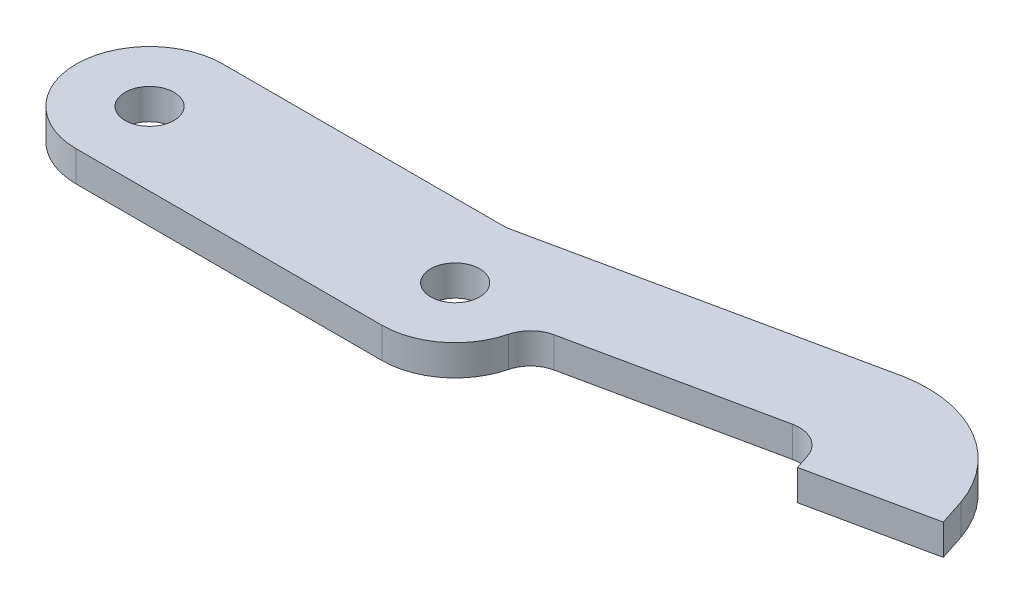
ISO-10303-21;
HEADER;
FILE_DESCRIPTION(('STEP AP214'),'2;1');
FILE_NAME('part.step','',(''),(''),'','','');
FILE_SCHEMA(('AUTOMOTIVE_DESIGN { 1 0 10303 214 1 1 1 1 }'));
ENDSEC;
DATA;
#1=APPLICATION_CONTEXT('core data for automotive mechanical design processes');
#2=APPLICATION_PROTOCOL_DEFINITION('international standard','automotive_design',2000,#1);
#3=PRODUCT_CONTEXT('',#1,'mechanical');
#4=PRODUCT('Part','Part','',(#3));
#5=PRODUCT_RELATED_PRODUCT_CATEGORY('part','',(#4));
#6=PRODUCT_DEFINITION_FORMATION('','',#4);
#7=PRODUCT_DEFINITION_CONTEXT('part definition',#1,'design');
#8=PRODUCT_DEFINITION('design','',#6,#7);
#9=PRODUCT_DEFINITION_SHAPE('','',#8);
#10=(LENGTH_UNIT() NAMED_UNIT(*) SI_UNIT(.MILLI.,.METRE.));
#11=(NAMED_UNIT(*) PLANE_ANGLE_UNIT() SI_UNIT($,.RADIAN.));
#12=(NAMED_UNIT(*) SI_UNIT($,.STERADIAN.) SOLID_ANGLE_UNIT());
#13=UNCERTAINTY_MEASURE_WITH_UNIT(LENGTH_MEASURE(1.E-05),#10,'distance_accuracy_value','');
#14=(GEOMETRIC_REPRESENTATION_CONTEXT(3) GLOBAL_UNCERTAINTY_ASSIGNED_CONTEXT((#13)) GLOBAL_UNIT_ASSIGNED_CONTEXT((#10,
#11,#12)) REPRESENTATION_CONTEXT('',''));
#15=CARTESIAN_POINT('',(0.,0.,0.));
#16=DIRECTION('',(0.,0.,1.));
#17=DIRECTION('',(1.,0.,0.));
#18=AXIS2_PLACEMENT_3D('',#15,#16,#17);
#19=CARTESIAN_POINT('',(77.2033165131237,3.75,-4.24115156953267));
#20=DIRECTION('',(0.,1.,0.));
#21=DIRECTION('',(0.,0.,1.));
#22=AXIS2_PLACEMENT_3D('',#19,#20,#21);
#23=PLANE('',#22);
#24=CARTESIAN_POINT('',(25.4283778031205,3.75,-2.37435628550275));
#25=DIRECTION('',(0.,1.,0.));
#26=DIRECTION('',(0.,0.,1.));
#27=AXIS2_PLACEMENT_3D('',#24,#25,#26);
#28=CIRCLE('',#27,2.);
#29=CARTESIAN_POINT('',(25.4283778031205,3.75,-0.374356285502748));
#30=VERTEX_POINT('',#29);
#31=EDGE_CURVE('E244',#30,#30,#28,.T.);
#32=ORIENTED_EDGE('',*,*,#31,.F.);
#33=EDGE_LOOP('',(#32));
#34=FACE_BOUND('',#33,.T.);
#35=CARTESIAN_POINT('',(77.2033165131237,3.75,-4.24115156953267));
#36=DIRECTION('',(0.,1.,0.));
#37=DIRECTION('',(0.,0.,1.));
#38=AXIS2_PLACEMENT_3D('',#35,#36,#37);
#39=CIRCLE('',#38,10.);
#40=CARTESIAN_POINT('',(86.648154320147,3.75,-7.52673200516709));
#41=VERTEX_POINT('',#40);
#42=CARTESIAN_POINT('',(75.4822098945899,3.75,-14.0919277829911));
#43=VERTEX_POINT('',#42);
#44=EDGE_CURVE('E134',#41,#43,#39,.T.);
#45=ORIENTED_EDGE('',*,*,#44,.T.);
#46=DIRECTION('',(-0.978147600733806,0.,0.20791169081776));
#47=VECTOR('',#46,1.);
#48=CARTESIAN_POINT('',(48.5831508744103,3.75,-8.37435628550275));
#49=LINE('',#48,#47);
#50=CARTESIAN_POINT('',(48.8401695132905,3.75,-8.42898728366823));
#51=VERTEX_POINT('',#50);
#52=EDGE_CURVE('E125',#43,#51,#49,.T.);
#53=ORIENTED_EDGE('',*,*,#52,.T.);
#54=CARTESIAN_POINT('',(48.3203902862461,3.75,-10.8743562855027));
#55=DIRECTION('',(0.,1.,0.));
#56=DIRECTION('',(0.,0.,1.));
#57=AXIS2_PLACEMENT_3D('',#54,#55,#56);
#58=CIRCLE('',#57,2.5);
#59=CARTESIAN_POINT('',(48.3203902862461,3.75,-8.37435628550275));
#60=VERTEX_POINT('',#59);
#61=EDGE_CURVE('E11',#51,#60,#58,.F.);
#62=ORIENTED_EDGE('',*,*,#61,.T.);
#63=DIRECTION('',(-1.,0.,0.));
#64=VECTOR('',#63,1.);
#65=CARTESIAN_POINT('',(25.4283778031205,3.75,-8.37435628550275));
#66=LINE('',#65,#64);
#67=CARTESIAN_POINT('',(25.4283778031205,3.75,-8.37435628550275));
#68=VERTEX_POINT('',#67);
#69=EDGE_CURVE('E133',#60,#68,#66,.T.);
#70=ORIENTED_EDGE('',*,*,#69,.T.);
#71=CARTESIAN_POINT('',(25.4283778031205,3.75,-2.37435628550275));
#72=DIRECTION('',(0.,1.,0.));
#73=DIRECTION('',(0.,0.,1.));
#74=AXIS2_PLACEMENT_3D('',#71,#72,#73);
#75=CIRCLE('',#74,6.);
#76=CARTESIAN_POINT('',(25.4283778031205,3.75,3.62564371449725));
#77=VERTEX_POINT('',#76);
#78=EDGE_CURVE('E252',#68,#77,#75,.T.);
#79=ORIENTED_EDGE('',*,*,#78,.T.);
#80=DIRECTION('',(1.,0.,0.));
#81=VECTOR('',#80,1.);
#82=CARTESIAN_POINT('',(25.4283778031205,3.75,3.62564371449725));
#83=LINE('',#82,#81);
#84=CARTESIAN_POINT('',(50.4283778031205,3.75,3.62564371449725));
#85=VERTEX_POINT('',#84);
#86=EDGE_CURVE('E231',#77,#85,#83,.T.);
#87=ORIENTED_EDGE('',*,*,#86,.T.);
#88=CARTESIAN_POINT('',(50.4283778031205,3.75,-2.37435628550275));
#89=DIRECTION('',(0.,1.,0.));
#90=DIRECTION('',(0.,0.,1.));
#91=AXIS2_PLACEMENT_3D('',#88,#89,#90);
#92=CIRCLE('',#91,6.);
#93=CARTESIAN_POINT('',(56.2460768440043,3.75,-0.906576373629143));
#94=VERTEX_POINT('',#93);
#95=EDGE_CURVE('E248',#85,#94,#92,.T.);
#96=ORIENTED_EDGE('',*,*,#95,.T.);
#97=CARTESIAN_POINT('',(58.6701181110392,3.75,-0.295001410348475));
#98=DIRECTION('',(0.,1.,0.));
#99=DIRECTION('',(0.,0.,1.));
#100=AXIS2_PLACEMENT_3D('',#97,#98,#99);
#101=CIRCLE('',#100,2.5);
#102=CARTESIAN_POINT('',(58.1503388839948,3.75,-2.74037041218299));
#103=VERTEX_POINT('',#102);
#104=EDGE_CURVE('E171',#94,#103,#101,.F.);
#105=ORIENTED_EDGE('',*,*,#104,.T.);
#106=DIRECTION('',(0.978147600733805,0.,-0.20791169081776));
#107=VECTOR('',#106,1.);
#108=CARTESIAN_POINT('',(56.4283778031205,3.75,-2.37435628550275));
#109=LINE('',#108,#107);
#110=CARTESIAN_POINT('',(74.2247109521193,3.75,-6.15708366998819));
#111=VERTEX_POINT('',#110);
#112=EDGE_CURVE('E182',#103,#111,#109,.T.);
#113=ORIENTED_EDGE('',*,*,#112,.T.);
#114=CARTESIAN_POINT('',(74.7444901791637,3.75,-3.71171466815367));
#115=DIRECTION('',(0.,1.,0.));
#116=DIRECTION('',(0.,0.,1.));
#117=AXIS2_PLACEMENT_3D('',#114,#115,#116);
#118=CIRCLE('',#117,2.5);
#119=CARTESIAN_POINT('',(77.1227747991611,3.75,-4.4822743778998));
#120=VERTEX_POINT('',#119);
#121=EDGE_CURVE('E175',#111,#120,#118,.F.);
#122=ORIENTED_EDGE('',*,*,#121,.T.);
#123=DIRECTION('',(0.308223883898451,0.,0.951313847998942));
#124=VECTOR('',#123,1.);
#125=CARTESIAN_POINT('',(77.5071613967651,3.75,-3.2958890509069));
#126=LINE('',#125,#124);
#127=CARTESIAN_POINT('',(77.5071613967651,3.75,-3.2958890509069));
#128=VERTEX_POINT('',#127);
#129=EDGE_CURVE('E179',#120,#128,#126,.T.);
#130=ORIENTED_EDGE('',*,*,#129,.T.);
#131=DIRECTION('',(0.978147600733807,0.,-0.207911690817753));
#132=VECTOR('',#131,1.);
#133=CARTESIAN_POINT('',(77.5071613967651,3.75,-3.2958890509069));
#134=LINE('',#133,#132);
#135=CARTESIAN_POINT('',(87.3416580589185,3.75,-5.38627584716947));
#136=VERTEX_POINT('',#135);
#137=EDGE_CURVE('E192',#128,#136,#134,.T.);
#138=ORIENTED_EDGE('',*,*,#137,.T.);
#139=DIRECTION('',(-0.308223883898451,0.,-0.951313847998942));
#140=VECTOR('',#139,1.);
#141=CARTESIAN_POINT('',(86.648154320147,3.75,-7.52673200516709));
#142=LINE('',#141,#140);
#143=EDGE_CURVE('E139',#136,#41,#142,.T.);
#144=ORIENTED_EDGE('',*,*,#143,.T.);
#145=EDGE_LOOP('',(#45,#53,#62,#70,#79,#87,#96,#105,#113,#122,#130,#138,#144));
#146=FACE_BOUND('',#145,.T.);
#147=CARTESIAN_POINT('',(50.4283778031205,3.75,-2.37435628550275));
#148=DIRECTION('',(0.,1.,0.));
#149=DIRECTION('',(0.,0.,1.));
#150=AXIS2_PLACEMENT_3D('',#147,#148,#149);
#151=CIRCLE('',#150,2.);
#152=CARTESIAN_POINT('',(50.4283778031205,3.75,-0.374356285502745));
#153=VERTEX_POINT('',#152);
#154=EDGE_CURVE('E258',#153,#153,#151,.T.);
#155=ORIENTED_EDGE('',*,*,#154,.F.);
#156=EDGE_LOOP('',(#155));
#157=FACE_BOUND('',#156,.T.);
#158=ADVANCED_FACE('F34',(#34,#146,#157),#23,.T.);
#159=CARTESIAN_POINT('',(77.2033165131237,1.25,-4.24115156953267));
#160=DIRECTION('',(0.,1.,0.));
#161=DIRECTION('',(0.,0.,1.));
#162=AXIS2_PLACEMENT_3D('',#159,#160,#161);
#163=PLANE('',#162);
#164=CARTESIAN_POINT('',(25.4283778031205,1.25,-2.37435628550275));
#165=DIRECTION('',(0.,1.,0.));
#166=DIRECTION('',(0.,0.,1.));
#167=AXIS2_PLACEMENT_3D('',#164,#165,#166);
#168=CIRCLE('',#167,2.);
#169=CARTESIAN_POINT('',(25.4283778031205,1.25,-0.374356285502748));
#170=VERTEX_POINT('',#169);
#171=EDGE_CURVE('E255',#170,#170,#168,.T.);
#172=ORIENTED_EDGE('',*,*,#171,.T.);
#173=EDGE_LOOP('',(#172));
#174=FACE_BOUND('',#173,.T.);
#175=CARTESIAN_POINT('',(77.2033165131237,1.25,-4.24115156953267));
#176=DIRECTION('',(0.,1.,0.));
#177=DIRECTION('',(0.,0.,1.));
#178=AXIS2_PLACEMENT_3D('',#175,#176,#177);
#179=CIRCLE('',#178,10.);
#180=CARTESIAN_POINT('',(86.648154320147,1.25,-7.52673200516709));
#181=VERTEX_POINT('',#180);
#182=CARTESIAN_POINT('',(75.4822098945899,1.25,-14.0919277829911));
#183=VERTEX_POINT('',#182);
#184=EDGE_CURVE('E147',#181,#183,#179,.T.);
#185=ORIENTED_EDGE('',*,*,#184,.F.);
#186=DIRECTION('',(-0.308223883898451,0.,-0.951313847998942));
#187=VECTOR('',#186,1.);
#188=CARTESIAN_POINT('',(86.648154320147,1.25,-7.52673200516709));
#189=LINE('',#188,#187);
#190=CARTESIAN_POINT('',(87.3416580589185,1.25,-5.38627584716947));
#191=VERTEX_POINT('',#190);
#192=EDGE_CURVE('E143',#191,#181,#189,.T.);
#193=ORIENTED_EDGE('',*,*,#192,.F.);
#194=DIRECTION('',(0.978147600733807,0.,-0.207911690817753));
#195=VECTOR('',#194,1.);
#196=CARTESIAN_POINT('',(77.5071613967651,1.25,-3.2958890509069));
#197=LINE('',#196,#195);
#198=CARTESIAN_POINT('',(77.5071613967651,1.25,-3.2958890509069));
#199=VERTEX_POINT('',#198);
#200=EDGE_CURVE('E207',#199,#191,#197,.T.);
#201=ORIENTED_EDGE('',*,*,#200,.F.);
#202=DIRECTION('',(0.308223883898451,0.,0.951313847998942));
#203=VECTOR('',#202,1.);
#204=CARTESIAN_POINT('',(77.5071613967651,1.25,-3.2958890509069));
#205=LINE('',#204,#203);
#206=CARTESIAN_POINT('',(77.1227747991611,1.25,-4.4822743778998));
#207=VERTEX_POINT('',#206);
#208=EDGE_CURVE('E201',#207,#199,#205,.T.);
#209=ORIENTED_EDGE('',*,*,#208,.F.);
#210=CARTESIAN_POINT('',(74.7444901791637,1.25,-3.71171466815367));
#211=DIRECTION('',(0.,1.,0.));
#212=DIRECTION('',(0.,0.,1.));
#213=AXIS2_PLACEMENT_3D('',#210,#211,#212);
#214=CIRCLE('',#213,2.5);
#215=CARTESIAN_POINT('',(74.2247109521193,1.25,-6.15708366998819));
#216=VERTEX_POINT('',#215);
#217=EDGE_CURVE('E173',#207,#216,#214,.T.);
#218=ORIENTED_EDGE('',*,*,#217,.T.);
#219=DIRECTION('',(0.978147600733805,0.,-0.20791169081776));
#220=VECTOR('',#219,1.);
#221=CARTESIAN_POINT('',(56.4283778031205,1.25,-2.37435628550275));
#222=LINE('',#221,#220);
#223=CARTESIAN_POINT('',(58.1503388839948,1.25,-2.74037041218299));
#224=VERTEX_POINT('',#223);
#225=EDGE_CURVE('E199',#224,#216,#222,.T.);
#226=ORIENTED_EDGE('',*,*,#225,.F.);
#227=CARTESIAN_POINT('',(58.6701181110392,1.25,-0.295001410348475));
#228=DIRECTION('',(0.,1.,0.));
#229=DIRECTION('',(0.,0.,1.));
#230=AXIS2_PLACEMENT_3D('',#227,#228,#229);
#231=CIRCLE('',#230,2.5);
#232=CARTESIAN_POINT('',(56.2460768440043,1.25,-0.906576373629143));
#233=VERTEX_POINT('',#232);
#234=EDGE_CURVE('E169',#224,#233,#231,.T.);
#235=ORIENTED_EDGE('',*,*,#234,.T.);
#236=CARTESIAN_POINT('',(50.4283778031205,1.25,-2.37435628550275));
#237=DIRECTION('',(0.,1.,0.));
#238=DIRECTION('',(0.,0.,1.));
#239=AXIS2_PLACEMENT_3D('',#236,#237,#238);
#240=CIRCLE('',#239,6.);
#241=CARTESIAN_POINT('',(50.4283778031205,1.25,3.62564371449725));
#242=VERTEX_POINT('',#241);
#243=EDGE_CURVE('E205',#242,#233,#240,.T.);
#244=ORIENTED_EDGE('',*,*,#243,.F.);
#245=DIRECTION('',(1.,0.,0.));
#246=VECTOR('',#245,1.);
#247=CARTESIAN_POINT('',(25.4283778031205,1.25,3.62564371449725));
#248=LINE('',#247,#246);
#249=CARTESIAN_POINT('',(25.4283778031205,1.25,3.62564371449725));
#250=VERTEX_POINT('',#249);
#251=EDGE_CURVE('E210',#250,#242,#248,.T.);
#252=ORIENTED_EDGE('',*,*,#251,.F.);
#253=CARTESIAN_POINT('',(25.4283778031205,1.25,-2.37435628550275));
#254=DIRECTION('',(0.,1.,0.));
#255=DIRECTION('',(0.,0.,1.));
#256=AXIS2_PLACEMENT_3D('',#253,#254,#255);
#257=CIRCLE('',#256,6.);
#258=CARTESIAN_POINT('',(25.4283778031205,1.25,-8.37435628550275));
#259=VERTEX_POINT('',#258);
#260=EDGE_CURVE('E236',#259,#250,#257,.T.);
#261=ORIENTED_EDGE('',*,*,#260,.F.);
#262=DIRECTION('',(-1.,0.,0.));
#263=VECTOR('',#262,1.);
#264=CARTESIAN_POINT('',(25.4283778031205,1.25,-8.37435628550275));
#265=LINE('',#264,#263);
#266=CARTESIAN_POINT('',(48.3203902862461,1.25,-8.37435628550275));
#267=VERTEX_POINT('',#266);
#268=EDGE_CURVE('E237',#267,#259,#265,.T.);
#269=ORIENTED_EDGE('',*,*,#268,.F.);
#270=CARTESIAN_POINT('',(48.3203902862461,1.25,-10.8743562855027));
#271=DIRECTION('',(0.,1.,0.));
#272=DIRECTION('',(0.,0.,1.));
#273=AXIS2_PLACEMENT_3D('',#270,#271,#272);
#274=CIRCLE('',#273,2.5);
#275=CARTESIAN_POINT('',(48.8401695132905,1.25,-8.42898728366823));
#276=VERTEX_POINT('',#275);
#277=EDGE_CURVE('E42',#267,#276,#274,.T.);
#278=ORIENTED_EDGE('',*,*,#277,.T.);
#279=DIRECTION('',(-0.978147600733806,0.,0.20791169081776));
#280=VECTOR('',#279,1.);
#281=CARTESIAN_POINT('',(48.5831508744103,1.25,-8.37435628550275));
#282=LINE('',#281,#280);
#283=EDGE_CURVE('E241',#183,#276,#282,.T.);
#284=ORIENTED_EDGE('',*,*,#283,.F.);
#285=EDGE_LOOP('',(#185,#193,#201,#209,#218,#226,#235,#244,#252,#261,#269,#278,#284));
#286=FACE_BOUND('',#285,.T.);
#287=CARTESIAN_POINT('',(50.4283778031205,1.25,-2.37435628550275));
#288=DIRECTION('',(0.,1.,0.));
#289=DIRECTION('',(0.,0.,1.));
#290=AXIS2_PLACEMENT_3D('',#287,#288,#289);
#291=CIRCLE('',#290,2.);
#292=CARTESIAN_POINT('',(50.4283778031205,1.25,-0.374356285502745));
#293=VERTEX_POINT('',#292);
#294=EDGE_CURVE('E261',#293,#293,#291,.T.);
#295=ORIENTED_EDGE('',*,*,#294,.T.);
#296=EDGE_LOOP('',(#295));
#297=FACE_BOUND('',#296,.T.);
#298=ADVANCED_FACE('F197',(#174,#286,#297),#163,.F.);
#299=CARTESIAN_POINT('',(77.2033165131237,3.75,-4.24115156953267));
#300=DIRECTION('',(0.,-1.,0.));
#301=DIRECTION('',(0.,0.,-1.));
#302=AXIS2_PLACEMENT_3D('',#299,#300,#301);
#303=CYLINDRICAL_SURFACE('',#302,10.);
#304=ORIENTED_EDGE('',*,*,#184,.T.);
#305=DIRECTION('',(0.,-1.,0.));
#306=VECTOR('',#305,1.);
#307=CARTESIAN_POINT('',(75.4822098945899,3.75,-14.0919277829911));
#308=LINE('',#307,#306);
#309=EDGE_CURVE('E129',#43,#183,#308,.T.);
#310=ORIENTED_EDGE('',*,*,#309,.F.);
#311=ORIENTED_EDGE('',*,*,#44,.F.);
#312=DIRECTION('',(0.,-1.,0.));
#313=VECTOR('',#312,1.);
#314=CARTESIAN_POINT('',(86.648154320147,3.75,-7.52673200516709));
#315=LINE('',#314,#313);
#316=EDGE_CURVE('E216',#41,#181,#315,.T.);
#317=ORIENTED_EDGE('',*,*,#316,.T.);
#318=EDGE_LOOP('',(#304,#310,#311,#317));
#319=FACE_BOUND('',#318,.T.);
#320=ADVANCED_FACE('F145',(#319),#303,.T.);
#321=CARTESIAN_POINT('',(48.5831508744103,3.75,-8.37435628550275));
#322=DIRECTION('',(0.20791169081776,0.,0.978147600733805));
#323=DIRECTION('',(0.978147600733805,0.,-0.20791169081776));
#324=AXIS2_PLACEMENT_3D('',#321,#322,#323);
#325=PLANE('',#324);
#326=ORIENTED_EDGE('',*,*,#283,.T.);
#327=DIRECTION('',(0.,-1.,0.));
#328=VECTOR('',#327,1.);
#329=CARTESIAN_POINT('',(48.8401695132905,3.75,-8.42898728366823));
#330=LINE('',#329,#328);
#331=EDGE_CURVE('E49',#276,#51,#330,.F.);
#332=ORIENTED_EDGE('',*,*,#331,.T.);
#333=ORIENTED_EDGE('',*,*,#52,.F.);
#334=ORIENTED_EDGE('',*,*,#309,.T.);
#335=EDGE_LOOP('',(#326,#332,#333,#334));
#336=FACE_BOUND('',#335,.T.);
#337=ADVANCED_FACE('F127',(#336),#325,.F.);
#338=CARTESIAN_POINT('',(25.4283778031205,3.75,-8.37435628550275));
#339=DIRECTION('',(0.,0.,1.));
#340=DIRECTION('',(1.,0.,0.));
#341=AXIS2_PLACEMENT_3D('',#338,#339,#340);
#342=PLANE('',#341);
#343=ORIENTED_EDGE('',*,*,#69,.F.);
#344=DIRECTION('',(0.,-1.,0.));
#345=VECTOR('',#344,1.);
#346=CARTESIAN_POINT('',(48.3203902862461,1.25,-8.37435628550275));
#347=LINE('',#346,#345);
#348=EDGE_CURVE('E165',#60,#267,#347,.T.);
#349=ORIENTED_EDGE('',*,*,#348,.T.);
#350=ORIENTED_EDGE('',*,*,#268,.T.);
#351=DIRECTION('',(0.,-1.,0.));
#352=VECTOR('',#351,1.);
#353=CARTESIAN_POINT('',(25.4283778031205,3.75,-8.37435628550275));
#354=LINE('',#353,#352);
#355=EDGE_CURVE('E149',#68,#259,#354,.T.);
#356=ORIENTED_EDGE('',*,*,#355,.F.);
#357=EDGE_LOOP('',(#343,#349,#350,#356));
#358=FACE_BOUND('',#357,.T.);
#359=ADVANCED_FACE('F303',(#358),#342,.F.);
#360=CARTESIAN_POINT('',(25.4283778031205,3.75,-2.37435628550275));
#361=DIRECTION('',(0.,-1.,0.));
#362=DIRECTION('',(0.,0.,-1.));
#363=AXIS2_PLACEMENT_3D('',#360,#361,#362);
#364=CYLINDRICAL_SURFACE('',#363,6.);
#365=ORIENTED_EDGE('',*,*,#260,.T.);
#366=DIRECTION('',(0.,-1.,0.));
#367=VECTOR('',#366,1.);
#368=CARTESIAN_POINT('',(25.4283778031205,3.75,3.62564371449725));
#369=LINE('',#368,#367);
#370=EDGE_CURVE('E154',#77,#250,#369,.T.);
#371=ORIENTED_EDGE('',*,*,#370,.F.);
#372=ORIENTED_EDGE('',*,*,#78,.F.);
#373=ORIENTED_EDGE('',*,*,#355,.T.);
#374=EDGE_LOOP('',(#365,#371,#372,#373));
#375=FACE_BOUND('',#374,.T.);
#376=ADVANCED_FACE('F300',(#375),#364,.T.);
#377=CARTESIAN_POINT('',(25.4283778031205,3.75,3.62564371449725));
#378=DIRECTION('',(0.,0.,-1.));
#379=DIRECTION('',(-1.,0.,0.));
#380=AXIS2_PLACEMENT_3D('',#377,#378,#379);
#381=PLANE('',#380);
#382=ORIENTED_EDGE('',*,*,#251,.T.);
#383=DIRECTION('',(0.,-1.,0.));
#384=VECTOR('',#383,1.);
#385=CARTESIAN_POINT('',(50.4283778031205,3.75,3.62564371449725));
#386=LINE('',#385,#384);
#387=EDGE_CURVE('E222',#85,#242,#386,.T.);
#388=ORIENTED_EDGE('',*,*,#387,.F.);
#389=ORIENTED_EDGE('',*,*,#86,.F.);
#390=ORIENTED_EDGE('',*,*,#370,.T.);
#391=EDGE_LOOP('',(#382,#388,#389,#390));
#392=FACE_BOUND('',#391,.T.);
#393=ADVANCED_FACE('F229',(#392),#381,.F.);
#394=CARTESIAN_POINT('',(50.4283778031205,3.75,-2.37435628550275));
#395=DIRECTION('',(0.,-1.,0.));
#396=DIRECTION('',(0.,0.,-1.));
#397=AXIS2_PLACEMENT_3D('',#394,#395,#396);
#398=CYLINDRICAL_SURFACE('',#397,6.);
#399=ORIENTED_EDGE('',*,*,#243,.T.);
#400=DIRECTION('',(0.,-1.,0.));
#401=VECTOR('',#400,1.);
#402=CARTESIAN_POINT('',(56.2460768440043,3.75,-0.906576373629144));
#403=LINE('',#402,#401);
#404=EDGE_CURVE('E160',#233,#94,#403,.F.);
#405=ORIENTED_EDGE('',*,*,#404,.T.);
#406=ORIENTED_EDGE('',*,*,#95,.F.);
#407=ORIENTED_EDGE('',*,*,#387,.T.);
#408=EDGE_LOOP('',(#399,#405,#406,#407));
#409=FACE_BOUND('',#408,.T.);
#410=ADVANCED_FACE('F294',(#409),#398,.T.);
#411=CARTESIAN_POINT('',(56.4283778031205,3.75,-2.37435628550275));
#412=DIRECTION('',(-0.20791169081776,0.,-0.978147600733806));
#413=DIRECTION('',(-0.978147600733806,0.,0.20791169081776));
#414=AXIS2_PLACEMENT_3D('',#411,#412,#413);
#415=PLANE('',#414);
#416=ORIENTED_EDGE('',*,*,#112,.F.);
#417=DIRECTION('',(0.,1.,0.));
#418=VECTOR('',#417,1.);
#419=CARTESIAN_POINT('',(58.1503388839948,1.25,-2.74037041218299));
#420=LINE('',#419,#418);
#421=EDGE_CURVE('E151',#103,#224,#420,.F.);
#422=ORIENTED_EDGE('',*,*,#421,.T.);
#423=ORIENTED_EDGE('',*,*,#225,.T.);
#424=DIRECTION('',(0.,-1.,0.));
#425=VECTOR('',#424,1.);
#426=CARTESIAN_POINT('',(74.2247109521193,3.75,-6.15708366998819));
#427=LINE('',#426,#425);
#428=EDGE_CURVE('E148',#216,#111,#427,.F.);
#429=ORIENTED_EDGE('',*,*,#428,.T.);
#430=EDGE_LOOP('',(#416,#422,#423,#429));
#431=FACE_BOUND('',#430,.T.);
#432=ADVANCED_FACE('F203',(#431),#415,.F.);
#433=CARTESIAN_POINT('',(77.5071613967651,3.75,-3.2958890509069));
#434=DIRECTION('',(0.951313847998942,0.,-0.308223883898451));
#435=DIRECTION('',(-0.308223883898451,0.,-0.951313847998942));
#436=AXIS2_PLACEMENT_3D('',#433,#434,#435);
#437=PLANE('',#436);
#438=ORIENTED_EDGE('',*,*,#129,.F.);
#439=DIRECTION('',(0.,-1.,0.));
#440=VECTOR('',#439,1.);
#441=CARTESIAN_POINT('',(77.1227747991611,1.25,-4.4822743778998));
#442=LINE('',#441,#440);
#443=EDGE_CURVE('E162',#120,#207,#442,.T.);
#444=ORIENTED_EDGE('',*,*,#443,.T.);
#445=ORIENTED_EDGE('',*,*,#208,.T.);
#446=DIRECTION('',(0.,-1.,0.));
#447=VECTOR('',#446,1.);
#448=CARTESIAN_POINT('',(77.5071613967651,3.75,-3.2958890509069));
#449=LINE('',#448,#447);
#450=EDGE_CURVE('E190',#128,#199,#449,.T.);
#451=ORIENTED_EDGE('',*,*,#450,.F.);
#452=EDGE_LOOP('',(#438,#444,#445,#451));
#453=FACE_BOUND('',#452,.T.);
#454=ADVANCED_FACE('F187',(#453),#437,.F.);
#455=CARTESIAN_POINT('',(77.5071613967651,3.75,-3.2958890509069));
#456=DIRECTION('',(-0.207911690817753,0.,-0.978147600733807));
#457=DIRECTION('',(-0.978147600733807,0.,0.207911690817753));
#458=AXIS2_PLACEMENT_3D('',#455,#456,#457);
#459=PLANE('',#458);
#460=ORIENTED_EDGE('',*,*,#200,.T.);
#461=DIRECTION('',(0.,-1.,0.));
#462=VECTOR('',#461,1.);
#463=CARTESIAN_POINT('',(87.3416580589185,3.75,-5.38627584716947));
#464=LINE('',#463,#462);
#465=EDGE_CURVE('E218',#136,#191,#464,.T.);
#466=ORIENTED_EDGE('',*,*,#465,.F.);
#467=ORIENTED_EDGE('',*,*,#137,.F.);
#468=ORIENTED_EDGE('',*,*,#450,.T.);
#469=EDGE_LOOP('',(#460,#466,#467,#468));
#470=FACE_BOUND('',#469,.T.);
#471=ADVANCED_FACE('F285',(#470),#459,.F.);
#472=CARTESIAN_POINT('',(86.648154320147,3.75,-7.52673200516709));
#473=DIRECTION('',(-0.951313847998942,0.,0.308223883898451));
#474=DIRECTION('',(0.308223883898451,0.,0.951313847998942));
#475=AXIS2_PLACEMENT_3D('',#472,#473,#474);
#476=PLANE('',#475);
#477=ORIENTED_EDGE('',*,*,#192,.T.);
#478=ORIENTED_EDGE('',*,*,#316,.F.);
#479=ORIENTED_EDGE('',*,*,#143,.F.);
#480=ORIENTED_EDGE('',*,*,#465,.T.);
#481=EDGE_LOOP('',(#477,#478,#479,#480));
#482=FACE_BOUND('',#481,.T.);
#483=ADVANCED_FACE('F282',(#482),#476,.F.);
#484=CARTESIAN_POINT('',(25.4283778031205,3.75,-2.37435628550275));
#485=DIRECTION('',(0.,-1.,0.));
#486=DIRECTION('',(0.,0.,-1.));
#487=AXIS2_PLACEMENT_3D('',#484,#485,#486);
#488=CYLINDRICAL_SURFACE('',#487,2.);
#489=ORIENTED_EDGE('',*,*,#31,.T.);
#490=EDGE_LOOP('',(#489));
#491=FACE_BOUND('',#490,.T.);
#492=ORIENTED_EDGE('',*,*,#171,.F.);
#493=EDGE_LOOP('',(#492));
#494=FACE_BOUND('',#493,.T.);
#495=ADVANCED_FACE('F279',(#491,#494),#488,.F.);
#496=CARTESIAN_POINT('',(50.4283778031205,3.75,-2.37435628550275));
#497=DIRECTION('',(0.,-1.,0.));
#498=DIRECTION('',(0.,0.,-1.));
#499=AXIS2_PLACEMENT_3D('',#496,#497,#498);
#500=CYLINDRICAL_SURFACE('',#499,2.);
#501=ORIENTED_EDGE('',*,*,#154,.T.);
#502=EDGE_LOOP('',(#501));
#503=FACE_BOUND('',#502,.T.);
#504=ORIENTED_EDGE('',*,*,#294,.F.);
#505=EDGE_LOOP('',(#504));
#506=FACE_BOUND('',#505,.T.);
#507=ADVANCED_FACE('F267',(#503,#506),#500,.F.);
#508=CARTESIAN_POINT('',(58.6701181110392,3.75,-0.295001410348475));
#509=DIRECTION('',(0.,-1.,0.));
#510=DIRECTION('',(0.,0.,-1.));
#511=AXIS2_PLACEMENT_3D('',#508,#509,#510);
#512=CYLINDRICAL_SURFACE('',#511,2.5);
#513=ORIENTED_EDGE('',*,*,#104,.F.);
#514=ORIENTED_EDGE('',*,*,#404,.F.);
#515=ORIENTED_EDGE('',*,*,#234,.F.);
#516=ORIENTED_EDGE('',*,*,#421,.F.);
#517=EDGE_LOOP('',(#513,#514,#515,#516));
#518=FACE_BOUND('',#517,.T.);
#519=ADVANCED_FACE('F311',(#518),#512,.F.);
#520=CARTESIAN_POINT('',(74.7444901791637,3.75,-3.71171466815367));
#521=DIRECTION('',(0.,1.,0.));
#522=DIRECTION('',(0.,0.,1.));
#523=AXIS2_PLACEMENT_3D('',#520,#521,#522);
#524=CYLINDRICAL_SURFACE('',#523,2.5);
#525=ORIENTED_EDGE('',*,*,#121,.F.);
#526=ORIENTED_EDGE('',*,*,#428,.F.);
#527=ORIENTED_EDGE('',*,*,#217,.F.);
#528=ORIENTED_EDGE('',*,*,#443,.F.);
#529=EDGE_LOOP('',(#525,#526,#527,#528));
#530=FACE_BOUND('',#529,.T.);
#531=ADVANCED_FACE('F194',(#530),#524,.F.);
#532=CARTESIAN_POINT('',(48.3203902862461,3.75,-10.8743562855027));
#533=DIRECTION('',(0.,1.,0.));
#534=DIRECTION('',(0.,0.,1.));
#535=AXIS2_PLACEMENT_3D('',#532,#533,#534);
#536=CYLINDRICAL_SURFACE('',#535,2.5);
#537=ORIENTED_EDGE('',*,*,#61,.F.);
#538=ORIENTED_EDGE('',*,*,#331,.F.);
#539=ORIENTED_EDGE('',*,*,#277,.F.);
#540=ORIENTED_EDGE('',*,*,#348,.F.);
#541=EDGE_LOOP('',(#537,#538,#539,#540));
#542=FACE_BOUND('',#541,.T.);
#543=ADVANCED_FACE('F36',(#542),#536,.F.);
#544=CLOSED_SHELL('',(#158,#298,#320,#337,#359,#376,#393,#410,#432,#454,#471,#483,#495,#507,
#519,#531,#543));
#545=MANIFOLD_SOLID_BREP('B2',#544);
#546=ADVANCED_BREP_SHAPE_REPRESENTATION('',(#18,#545),#14);
#547=SHAPE_DEFINITION_REPRESENTATION(#9,#546);
ENDSEC;
END-ISO-10303-21;
